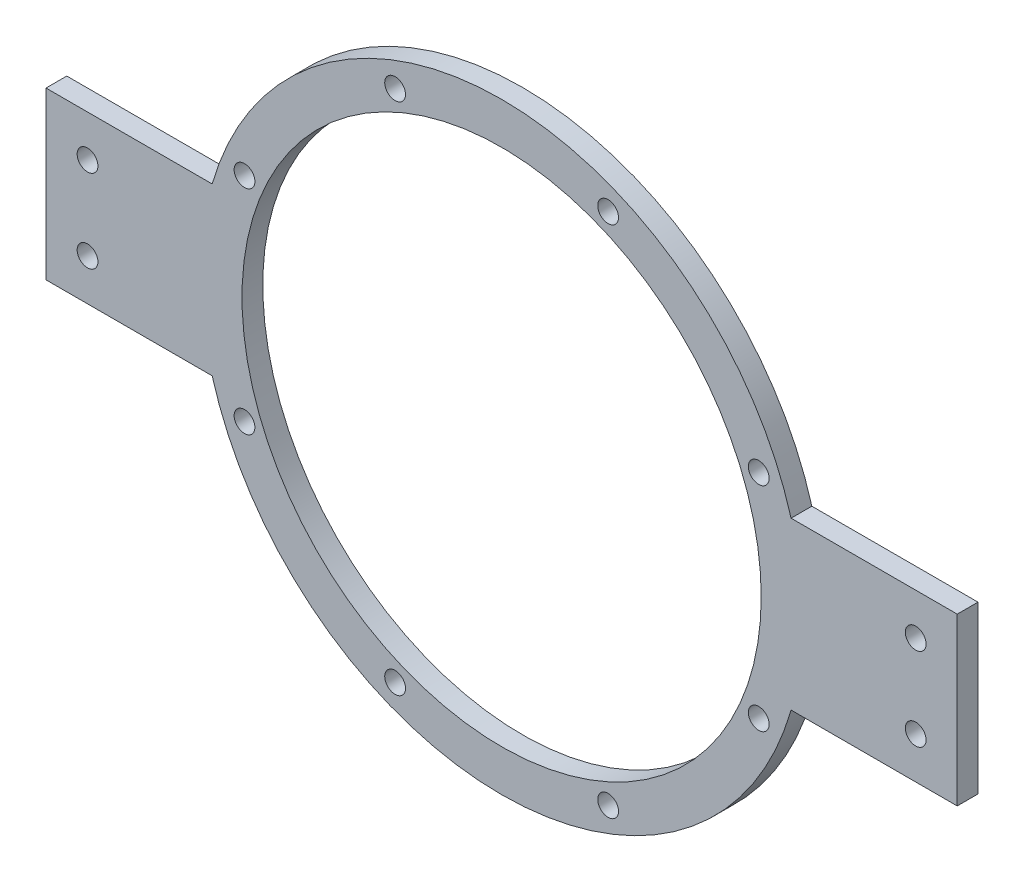
ISO-10303-21;
HEADER;
FILE_DESCRIPTION(('STEP AP214'),'2;1');
FILE_NAME('part.step','',(''),(''),'','','');
FILE_SCHEMA(('AUTOMOTIVE_DESIGN { 1 0 10303 214 1 1 1 1 }'));
ENDSEC;
DATA;
#1=APPLICATION_CONTEXT('core data for automotive mechanical design processes');
#2=APPLICATION_PROTOCOL_DEFINITION('international standard','automotive_design',2000,#1);
#3=PRODUCT_CONTEXT('',#1,'mechanical');
#4=PRODUCT('Part','Part','',(#3));
#5=PRODUCT_RELATED_PRODUCT_CATEGORY('part','',(#4));
#6=PRODUCT_DEFINITION_FORMATION('','',#4);
#7=PRODUCT_DEFINITION_CONTEXT('part definition',#1,'design');
#8=PRODUCT_DEFINITION('design','',#6,#7);
#9=PRODUCT_DEFINITION_SHAPE('','',#8);
#10=(LENGTH_UNIT() NAMED_UNIT(*) SI_UNIT(.MILLI.,.METRE.));
#11=(NAMED_UNIT(*) PLANE_ANGLE_UNIT() SI_UNIT($,.RADIAN.));
#12=(NAMED_UNIT(*) SI_UNIT($,.STERADIAN.) SOLID_ANGLE_UNIT());
#13=UNCERTAINTY_MEASURE_WITH_UNIT(LENGTH_MEASURE(1.E-05),#10,'distance_accuracy_value','');
#14=(GEOMETRIC_REPRESENTATION_CONTEXT(3) GLOBAL_UNCERTAINTY_ASSIGNED_CONTEXT((#13)) GLOBAL_UNIT_ASSIGNED_CONTEXT((#10,
#11,#12)) REPRESENTATION_CONTEXT('',''));
#15=CARTESIAN_POINT('',(0.,0.,0.));
#16=DIRECTION('',(0.,0.,1.));
#17=DIRECTION('',(1.,0.,0.));
#18=AXIS2_PLACEMENT_3D('',#15,#16,#17);
#19=CARTESIAN_POINT('',(0.,0.,6.35));
#20=DIRECTION('',(0.,0.,1.));
#21=DIRECTION('',(1.,0.,0.));
#22=AXIS2_PLACEMENT_3D('',#19,#20,#21);
#23=PLANE('',#22);
#24=CARTESIAN_POINT('',(-32.5625332599455,-78.6129094213854,6.35));
#25=DIRECTION('',(0.,0.,1.));
#26=DIRECTION('',(1.,0.,0.));
#27=AXIS2_PLACEMENT_3D('',#24,#25,#26);
#28=CIRCLE('',#27,3.17500000000706);
#29=CARTESIAN_POINT('',(-29.3875332599384,-78.6129094213854,6.35));
#30=VERTEX_POINT('',#29);
#31=EDGE_CURVE('E362',#30,#30,#28,.T.);
#32=ORIENTED_EDGE('',*,*,#31,.F.);
#33=EDGE_LOOP('',(#32));
#34=FACE_BOUND('',#33,.T.);
#35=CARTESIAN_POINT('',(-126.602235141266,12.6999999999999,6.35));
#36=DIRECTION('',(0.,0.,1.));
#37=DIRECTION('',(1.,0.,0.));
#38=AXIS2_PLACEMENT_3D('',#35,#36,#37);
#39=CIRCLE('',#38,3.175);
#40=CARTESIAN_POINT('',(-123.427235141266,12.6999999999999,6.35));
#41=VERTEX_POINT('',#40);
#42=EDGE_CURVE('E368',#41,#41,#39,.T.);
#43=ORIENTED_EDGE('',*,*,#42,.F.);
#44=EDGE_LOOP('',(#43));
#45=FACE_BOUND('',#44,.T.);
#46=CARTESIAN_POINT('',(32.5625332599455,78.6129094213854,6.35));
#47=DIRECTION('',(0.,0.,1.));
#48=DIRECTION('',(1.,0.,0.));
#49=AXIS2_PLACEMENT_3D('',#46,#47,#48);
#50=CIRCLE('',#49,3.17500000000719);
#51=CARTESIAN_POINT('',(35.7375332599527,78.6129094213854,6.35));
#52=VERTEX_POINT('',#51);
#53=EDGE_CURVE('E382',#52,#52,#50,.T.);
#54=ORIENTED_EDGE('',*,*,#53,.F.);
#55=EDGE_LOOP('',(#54));
#56=FACE_BOUND('',#55,.T.);
#57=CARTESIAN_POINT('',(78.6129094213854,32.5625332599455,6.35));
#58=DIRECTION('',(0.,0.,1.));
#59=DIRECTION('',(1.,0.,0.));
#60=AXIS2_PLACEMENT_3D('',#57,#58,#59);
#61=CIRCLE('',#60,3.17500000000719);
#62=CARTESIAN_POINT('',(81.7879094213926,32.5625332599455,6.35));
#63=VERTEX_POINT('',#62);
#64=EDGE_CURVE('E377',#63,#63,#61,.T.);
#65=ORIENTED_EDGE('',*,*,#64,.F.);
#66=EDGE_LOOP('',(#65));
#67=FACE_BOUND('',#66,.T.);
#68=CARTESIAN_POINT('',(126.602235141266,-12.7,6.35));
#69=DIRECTION('',(0.,0.,1.));
#70=DIRECTION('',(1.,0.,0.));
#71=AXIS2_PLACEMENT_3D('',#68,#69,#70);
#72=CIRCLE('',#71,3.175);
#73=CARTESIAN_POINT('',(129.777235141266,-12.7,6.35));
#74=VERTEX_POINT('',#73);
#75=EDGE_CURVE('E381',#74,#74,#72,.T.);
#76=ORIENTED_EDGE('',*,*,#75,.F.);
#77=EDGE_LOOP('',(#76));
#78=FACE_BOUND('',#77,.T.);
#79=CARTESIAN_POINT('',(126.602235141266,12.7000000000001,6.35));
#80=DIRECTION('',(0.,0.,1.));
#81=DIRECTION('',(1.,0.,0.));
#82=AXIS2_PLACEMENT_3D('',#79,#80,#81);
#83=CIRCLE('',#82,3.175);
#84=CARTESIAN_POINT('',(129.777235141266,12.7000000000001,6.35));
#85=VERTEX_POINT('',#84);
#86=EDGE_CURVE('E397',#85,#85,#83,.T.);
#87=ORIENTED_EDGE('',*,*,#86,.F.);
#88=EDGE_LOOP('',(#87));
#89=FACE_BOUND('',#88,.T.);
#90=CARTESIAN_POINT('',(78.6129094213854,-32.5625332599455,6.35));
#91=DIRECTION('',(0.,0.,1.));
#92=DIRECTION('',(1.,0.,0.));
#93=AXIS2_PLACEMENT_3D('',#90,#91,#92);
#94=CIRCLE('',#93,3.17500000000714);
#95=CARTESIAN_POINT('',(81.7879094213925,-32.5625332599455,6.35));
#96=VERTEX_POINT('',#95);
#97=EDGE_CURVE('E393',#96,#96,#94,.T.);
#98=ORIENTED_EDGE('',*,*,#97,.F.);
#99=EDGE_LOOP('',(#98));
#100=FACE_BOUND('',#99,.T.);
#101=CARTESIAN_POINT('',(-78.6129094213854,-32.5625332599455,6.35));
#102=DIRECTION('',(0.,0.,1.));
#103=DIRECTION('',(1.,0.,0.));
#104=AXIS2_PLACEMENT_3D('',#101,#102,#103);
#105=CIRCLE('',#104,3.17500000000706);
#106=CARTESIAN_POINT('',(-75.4379094213783,-32.5625332599455,6.35));
#107=VERTEX_POINT('',#106);
#108=EDGE_CURVE('E389',#107,#107,#105,.T.);
#109=ORIENTED_EDGE('',*,*,#108,.F.);
#110=EDGE_LOOP('',(#109));
#111=FACE_BOUND('',#110,.T.);
#112=CARTESIAN_POINT('',(32.5625332599455,-78.6129094213854,6.35));
#113=DIRECTION('',(0.,0.,1.));
#114=DIRECTION('',(1.,0.,0.));
#115=AXIS2_PLACEMENT_3D('',#112,#113,#114);
#116=CIRCLE('',#115,3.17500000000712);
#117=CARTESIAN_POINT('',(35.7375332599526,-78.6129094213854,6.35));
#118=VERTEX_POINT('',#117);
#119=EDGE_CURVE('E348',#118,#118,#116,.T.);
#120=ORIENTED_EDGE('',*,*,#119,.F.);
#121=EDGE_LOOP('',(#120));
#122=FACE_BOUND('',#121,.T.);
#123=CARTESIAN_POINT('',(-32.5625332599455,78.6129094213854,6.35));
#124=DIRECTION('',(0.,0.,1.));
#125=DIRECTION('',(1.,0.,0.));
#126=AXIS2_PLACEMENT_3D('',#123,#124,#125);
#127=CIRCLE('',#126,3.17500000000714);
#128=CARTESIAN_POINT('',(-29.3875332599383,78.6129094213854,6.35));
#129=VERTEX_POINT('',#128);
#130=EDGE_CURVE('E363',#129,#129,#127,.T.);
#131=ORIENTED_EDGE('',*,*,#130,.F.);
#132=EDGE_LOOP('',(#131));
#133=FACE_BOUND('',#132,.T.);
#134=CARTESIAN_POINT('',(-78.6129094213854,32.5625332599455,6.35));
#135=DIRECTION('',(0.,0.,1.));
#136=DIRECTION('',(1.,0.,0.));
#137=AXIS2_PLACEMENT_3D('',#134,#135,#136);
#138=CIRCLE('',#137,3.17500000000707);
#139=CARTESIAN_POINT('',(-75.4379094213783,32.5625332599455,6.35));
#140=VERTEX_POINT('',#139);
#141=EDGE_CURVE('E371',#140,#140,#138,.T.);
#142=ORIENTED_EDGE('',*,*,#141,.F.);
#143=EDGE_LOOP('',(#142));
#144=FACE_BOUND('',#143,.T.);
#145=CARTESIAN_POINT('',(-126.602235141266,-12.7,6.35));
#146=DIRECTION('',(0.,0.,1.));
#147=DIRECTION('',(1.,0.,0.));
#148=AXIS2_PLACEMENT_3D('',#145,#146,#147);
#149=CIRCLE('',#148,3.175);
#150=CARTESIAN_POINT('',(-123.427235141266,-12.7,6.35));
#151=VERTEX_POINT('',#150);
#152=EDGE_CURVE('E193',#151,#151,#149,.T.);
#153=ORIENTED_EDGE('',*,*,#152,.F.);
#154=EDGE_LOOP('',(#153));
#155=FACE_BOUND('',#154,.T.);
#156=DIRECTION('',(0.,-1.,0.));
#157=VECTOR('',#156,1.);
#158=CARTESIAN_POINT('',(-139.302235141266,25.4,6.35));
#159=LINE('',#158,#157);
#160=CARTESIAN_POINT('',(-139.302235141266,25.4,6.35));
#161=VERTEX_POINT('',#160);
#162=CARTESIAN_POINT('',(-139.302235141266,-25.4,6.35));
#163=VERTEX_POINT('',#162);
#164=EDGE_CURVE('E170',#161,#163,#159,.T.);
#165=ORIENTED_EDGE('',*,*,#164,.T.);
#166=DIRECTION('',(1.,0.,0.));
#167=VECTOR('',#166,1.);
#168=CARTESIAN_POINT('',(-139.302235141266,-25.4,6.35));
#169=LINE('',#168,#167);
#170=CARTESIAN_POINT('',(-88.5022351412663,-25.4000000000001,6.35));
#171=VERTEX_POINT('',#170);
#172=EDGE_CURVE('E106',#163,#171,#169,.T.);
#173=ORIENTED_EDGE('',*,*,#172,.T.);
#174=CARTESIAN_POINT('',(0.,0.,6.35));
#175=DIRECTION('',(0.,0.,1.));
#176=DIRECTION('',(1.,0.,0.));
#177=AXIS2_PLACEMENT_3D('',#174,#175,#176);
#178=CIRCLE('',#177,92.075);
#179=CARTESIAN_POINT('',(88.5022351412664,-25.4,6.35));
#180=VERTEX_POINT('',#179);
#181=EDGE_CURVE('E252',#171,#180,#178,.T.);
#182=ORIENTED_EDGE('',*,*,#181,.T.);
#183=DIRECTION('',(1.,0.,0.));
#184=VECTOR('',#183,1.);
#185=CARTESIAN_POINT('',(139.302235141266,-25.3999999999999,6.35));
#186=LINE('',#185,#184);
#187=CARTESIAN_POINT('',(139.302235141266,-25.3999999999999,6.35));
#188=VERTEX_POINT('',#187);
#189=EDGE_CURVE('E255',#180,#188,#186,.T.);
#190=ORIENTED_EDGE('',*,*,#189,.T.);
#191=DIRECTION('',(0.,1.,0.));
#192=VECTOR('',#191,1.);
#193=CARTESIAN_POINT('',(139.302235141266,25.4000000000001,6.35));
#194=LINE('',#193,#192);
#195=CARTESIAN_POINT('',(139.302235141266,25.4000000000001,6.35));
#196=VERTEX_POINT('',#195);
#197=EDGE_CURVE('E125',#188,#196,#194,.T.);
#198=ORIENTED_EDGE('',*,*,#197,.T.);
#199=DIRECTION('',(-1.,0.,0.));
#200=VECTOR('',#199,1.);
#201=CARTESIAN_POINT('',(139.302235141266,25.4000000000001,6.35));
#202=LINE('',#201,#200);
#203=CARTESIAN_POINT('',(88.5022351412664,25.4,6.35));
#204=VERTEX_POINT('',#203);
#205=EDGE_CURVE('E119',#196,#204,#202,.T.);
#206=ORIENTED_EDGE('',*,*,#205,.T.);
#207=CARTESIAN_POINT('',(0.,0.,6.35));
#208=DIRECTION('',(0.,0.,1.));
#209=DIRECTION('',(1.,0.,0.));
#210=AXIS2_PLACEMENT_3D('',#207,#208,#209);
#211=CIRCLE('',#210,92.075);
#212=CARTESIAN_POINT('',(-88.5022351412664,25.3999999999999,6.35));
#213=VERTEX_POINT('',#212);
#214=EDGE_CURVE('E123',#204,#213,#211,.T.);
#215=ORIENTED_EDGE('',*,*,#214,.T.);
#216=DIRECTION('',(-1.,0.,0.));
#217=VECTOR('',#216,1.);
#218=CARTESIAN_POINT('',(-139.302235141266,25.4,6.35));
#219=LINE('',#218,#217);
#220=EDGE_CURVE('E63',#213,#161,#219,.T.);
#221=ORIENTED_EDGE('',*,*,#220,.T.);
#222=EDGE_LOOP('',(#165,#173,#182,#190,#198,#206,#215,#221));
#223=FACE_BOUND('',#222,.T.);
#224=CARTESIAN_POINT('',(0.,0.,6.35));
#225=DIRECTION('',(0.,0.,1.));
#226=DIRECTION('',(1.,0.,0.));
#227=AXIS2_PLACEMENT_3D('',#224,#225,#226);
#228=CIRCLE('',#227,79.375);
#229=CARTESIAN_POINT('',(79.375,0.,6.35));
#230=VERTEX_POINT('',#229);
#231=EDGE_CURVE('E152',#230,#230,#228,.T.);
#232=ORIENTED_EDGE('',*,*,#231,.F.);
#233=EDGE_LOOP('',(#232));
#234=FACE_BOUND('',#233,.T.);
#235=ADVANCED_FACE('F43',(#34,#45,#56,#67,#78,#89,#100,#111,#122,#133,#144,#155,#223,#234),#23,.T.);
#236=CARTESIAN_POINT('',(0.,0.,0.));
#237=DIRECTION('',(0.,0.,1.));
#238=DIRECTION('',(1.,0.,0.));
#239=AXIS2_PLACEMENT_3D('',#236,#237,#238);
#240=PLANE('',#239);
#241=CARTESIAN_POINT('',(-32.5625332599455,-78.6129094213854,0.));
#242=DIRECTION('',(0.,0.,1.));
#243=DIRECTION('',(1.,0.,0.));
#244=AXIS2_PLACEMENT_3D('',#241,#242,#243);
#245=CIRCLE('',#244,3.17500000000706);
#246=CARTESIAN_POINT('',(-29.3875332599384,-78.6129094213854,0.));
#247=VERTEX_POINT('',#246);
#248=EDGE_CURVE('E47',#247,#247,#245,.T.);
#249=ORIENTED_EDGE('',*,*,#248,.T.);
#250=EDGE_LOOP('',(#249));
#251=FACE_BOUND('',#250,.T.);
#252=CARTESIAN_POINT('',(-126.602235141266,12.6999999999999,0.));
#253=DIRECTION('',(0.,0.,1.));
#254=DIRECTION('',(1.,0.,0.));
#255=AXIS2_PLACEMENT_3D('',#252,#253,#254);
#256=CIRCLE('',#255,3.175);
#257=CARTESIAN_POINT('',(-123.427235141266,12.6999999999999,0.));
#258=VERTEX_POINT('',#257);
#259=EDGE_CURVE('E228',#258,#258,#256,.T.);
#260=ORIENTED_EDGE('',*,*,#259,.T.);
#261=EDGE_LOOP('',(#260));
#262=FACE_BOUND('',#261,.T.);
#263=CARTESIAN_POINT('',(32.5625332599455,78.6129094213854,0.));
#264=DIRECTION('',(0.,0.,1.));
#265=DIRECTION('',(1.,0.,0.));
#266=AXIS2_PLACEMENT_3D('',#263,#264,#265);
#267=CIRCLE('',#266,3.17500000000719);
#268=CARTESIAN_POINT('',(35.7375332599527,78.6129094213854,0.));
#269=VERTEX_POINT('',#268);
#270=EDGE_CURVE('E225',#269,#269,#267,.T.);
#271=ORIENTED_EDGE('',*,*,#270,.T.);
#272=EDGE_LOOP('',(#271));
#273=FACE_BOUND('',#272,.T.);
#274=CARTESIAN_POINT('',(78.6129094213854,32.5625332599455,0.));
#275=DIRECTION('',(0.,0.,1.));
#276=DIRECTION('',(1.,0.,0.));
#277=AXIS2_PLACEMENT_3D('',#274,#275,#276);
#278=CIRCLE('',#277,3.17500000000719);
#279=CARTESIAN_POINT('',(81.7879094213926,32.5625332599455,0.));
#280=VERTEX_POINT('',#279);
#281=EDGE_CURVE('E221',#280,#280,#278,.T.);
#282=ORIENTED_EDGE('',*,*,#281,.T.);
#283=EDGE_LOOP('',(#282));
#284=FACE_BOUND('',#283,.T.);
#285=CARTESIAN_POINT('',(126.602235141266,-12.7,0.));
#286=DIRECTION('',(0.,0.,1.));
#287=DIRECTION('',(1.,0.,0.));
#288=AXIS2_PLACEMENT_3D('',#285,#286,#287);
#289=CIRCLE('',#288,3.175);
#290=CARTESIAN_POINT('',(129.777235141266,-12.7,0.));
#291=VERTEX_POINT('',#290);
#292=EDGE_CURVE('E217',#291,#291,#289,.T.);
#293=ORIENTED_EDGE('',*,*,#292,.T.);
#294=EDGE_LOOP('',(#293));
#295=FACE_BOUND('',#294,.T.);
#296=CARTESIAN_POINT('',(126.602235141266,12.7000000000001,0.));
#297=DIRECTION('',(0.,0.,1.));
#298=DIRECTION('',(1.,0.,0.));
#299=AXIS2_PLACEMENT_3D('',#296,#297,#298);
#300=CIRCLE('',#299,3.175);
#301=CARTESIAN_POINT('',(129.777235141266,12.7000000000001,0.));
#302=VERTEX_POINT('',#301);
#303=EDGE_CURVE('E213',#302,#302,#300,.T.);
#304=ORIENTED_EDGE('',*,*,#303,.T.);
#305=EDGE_LOOP('',(#304));
#306=FACE_BOUND('',#305,.T.);
#307=CARTESIAN_POINT('',(78.6129094213854,-32.5625332599455,0.));
#308=DIRECTION('',(0.,0.,1.));
#309=DIRECTION('',(1.,0.,0.));
#310=AXIS2_PLACEMENT_3D('',#307,#308,#309);
#311=CIRCLE('',#310,3.17500000000714);
#312=CARTESIAN_POINT('',(81.7879094213925,-32.5625332599455,0.));
#313=VERTEX_POINT('',#312);
#314=EDGE_CURVE('E209',#313,#313,#311,.T.);
#315=ORIENTED_EDGE('',*,*,#314,.T.);
#316=EDGE_LOOP('',(#315));
#317=FACE_BOUND('',#316,.T.);
#318=CARTESIAN_POINT('',(-78.6129094213854,-32.5625332599455,0.));
#319=DIRECTION('',(0.,0.,1.));
#320=DIRECTION('',(1.,0.,0.));
#321=AXIS2_PLACEMENT_3D('',#318,#319,#320);
#322=CIRCLE('',#321,3.17500000000706);
#323=CARTESIAN_POINT('',(-75.4379094213783,-32.5625332599455,0.));
#324=VERTEX_POINT('',#323);
#325=EDGE_CURVE('E205',#324,#324,#322,.T.);
#326=ORIENTED_EDGE('',*,*,#325,.T.);
#327=EDGE_LOOP('',(#326));
#328=FACE_BOUND('',#327,.T.);
#329=CARTESIAN_POINT('',(32.5625332599455,-78.6129094213854,0.));
#330=DIRECTION('',(0.,0.,1.));
#331=DIRECTION('',(1.,0.,0.));
#332=AXIS2_PLACEMENT_3D('',#329,#330,#331);
#333=CIRCLE('',#332,3.17500000000712);
#334=CARTESIAN_POINT('',(35.7375332599526,-78.6129094213854,0.));
#335=VERTEX_POINT('',#334);
#336=EDGE_CURVE('E201',#335,#335,#333,.T.);
#337=ORIENTED_EDGE('',*,*,#336,.T.);
#338=EDGE_LOOP('',(#337));
#339=FACE_BOUND('',#338,.T.);
#340=CARTESIAN_POINT('',(-32.5625332599455,78.6129094213854,0.));
#341=DIRECTION('',(0.,0.,1.));
#342=DIRECTION('',(1.,0.,0.));
#343=AXIS2_PLACEMENT_3D('',#340,#341,#342);
#344=CIRCLE('',#343,3.17500000000714);
#345=CARTESIAN_POINT('',(-29.3875332599383,78.6129094213854,0.));
#346=VERTEX_POINT('',#345);
#347=EDGE_CURVE('E197',#346,#346,#344,.T.);
#348=ORIENTED_EDGE('',*,*,#347,.T.);
#349=EDGE_LOOP('',(#348));
#350=FACE_BOUND('',#349,.T.);
#351=CARTESIAN_POINT('',(-78.6129094213854,32.5625332599455,0.));
#352=DIRECTION('',(0.,0.,1.));
#353=DIRECTION('',(1.,0.,0.));
#354=AXIS2_PLACEMENT_3D('',#351,#352,#353);
#355=CIRCLE('',#354,3.17500000000707);
#356=CARTESIAN_POINT('',(-75.4379094213783,32.5625332599455,0.));
#357=VERTEX_POINT('',#356);
#358=EDGE_CURVE('E192',#357,#357,#355,.T.);
#359=ORIENTED_EDGE('',*,*,#358,.T.);
#360=EDGE_LOOP('',(#359));
#361=FACE_BOUND('',#360,.T.);
#362=CARTESIAN_POINT('',(-126.602235141266,-12.7,0.));
#363=DIRECTION('',(0.,0.,1.));
#364=DIRECTION('',(1.,0.,0.));
#365=AXIS2_PLACEMENT_3D('',#362,#363,#364);
#366=CIRCLE('',#365,3.175);
#367=CARTESIAN_POINT('',(-123.427235141266,-12.7,0.));
#368=VERTEX_POINT('',#367);
#369=EDGE_CURVE('E188',#368,#368,#366,.T.);
#370=ORIENTED_EDGE('',*,*,#369,.T.);
#371=EDGE_LOOP('',(#370));
#372=FACE_BOUND('',#371,.T.);
#373=DIRECTION('',(0.,-1.,0.));
#374=VECTOR('',#373,1.);
#375=CARTESIAN_POINT('',(-139.302235141266,25.4,0.));
#376=LINE('',#375,#374);
#377=CARTESIAN_POINT('',(-139.302235141266,25.4,0.));
#378=VERTEX_POINT('',#377);
#379=CARTESIAN_POINT('',(-139.302235141266,-25.4,0.));
#380=VERTEX_POINT('',#379);
#381=EDGE_CURVE('E147',#378,#380,#376,.T.);
#382=ORIENTED_EDGE('',*,*,#381,.F.);
#383=DIRECTION('',(-1.,0.,0.));
#384=VECTOR('',#383,1.);
#385=CARTESIAN_POINT('',(-139.302235141266,25.4,0.));
#386=LINE('',#385,#384);
#387=CARTESIAN_POINT('',(-88.5022351412664,25.3999999999999,0.));
#388=VERTEX_POINT('',#387);
#389=EDGE_CURVE('E98',#388,#378,#386,.T.);
#390=ORIENTED_EDGE('',*,*,#389,.F.);
#391=CARTESIAN_POINT('',(0.,0.,0.));
#392=DIRECTION('',(0.,0.,1.));
#393=DIRECTION('',(1.,0.,0.));
#394=AXIS2_PLACEMENT_3D('',#391,#392,#393);
#395=CIRCLE('',#394,92.075);
#396=CARTESIAN_POINT('',(88.5022351412664,25.4,0.));
#397=VERTEX_POINT('',#396);
#398=EDGE_CURVE('E92',#397,#388,#395,.T.);
#399=ORIENTED_EDGE('',*,*,#398,.F.);
#400=DIRECTION('',(-1.,0.,0.));
#401=VECTOR('',#400,1.);
#402=CARTESIAN_POINT('',(139.302235141266,25.4000000000001,0.));
#403=LINE('',#402,#401);
#404=CARTESIAN_POINT('',(139.302235141266,25.4000000000001,0.));
#405=VERTEX_POINT('',#404);
#406=EDGE_CURVE('E134',#405,#397,#403,.T.);
#407=ORIENTED_EDGE('',*,*,#406,.F.);
#408=DIRECTION('',(0.,1.,0.));
#409=VECTOR('',#408,1.);
#410=CARTESIAN_POINT('',(139.302235141266,25.4000000000001,0.));
#411=LINE('',#410,#409);
#412=CARTESIAN_POINT('',(139.302235141266,-25.3999999999999,0.));
#413=VERTEX_POINT('',#412);
#414=EDGE_CURVE('E161',#413,#405,#411,.T.);
#415=ORIENTED_EDGE('',*,*,#414,.F.);
#416=DIRECTION('',(1.,0.,0.));
#417=VECTOR('',#416,1.);
#418=CARTESIAN_POINT('',(139.302235141266,-25.3999999999999,0.));
#419=LINE('',#418,#417);
#420=CARTESIAN_POINT('',(88.5022351412664,-25.4,0.));
#421=VERTEX_POINT('',#420);
#422=EDGE_CURVE('E158',#421,#413,#419,.T.);
#423=ORIENTED_EDGE('',*,*,#422,.F.);
#424=CARTESIAN_POINT('',(0.,0.,0.));
#425=DIRECTION('',(0.,0.,1.));
#426=DIRECTION('',(1.,0.,0.));
#427=AXIS2_PLACEMENT_3D('',#424,#425,#426);
#428=CIRCLE('',#427,92.075);
#429=CARTESIAN_POINT('',(-88.5022351412663,-25.4000000000001,0.));
#430=VERTEX_POINT('',#429);
#431=EDGE_CURVE('E155',#430,#421,#428,.T.);
#432=ORIENTED_EDGE('',*,*,#431,.F.);
#433=DIRECTION('',(1.,0.,0.));
#434=VECTOR('',#433,1.);
#435=CARTESIAN_POINT('',(-139.302235141266,-25.4,0.));
#436=LINE('',#435,#434);
#437=EDGE_CURVE('E151',#380,#430,#436,.T.);
#438=ORIENTED_EDGE('',*,*,#437,.F.);
#439=EDGE_LOOP('',(#382,#390,#399,#407,#415,#423,#432,#438));
#440=FACE_BOUND('',#439,.T.);
#441=CARTESIAN_POINT('',(0.,0.,0.));
#442=DIRECTION('',(0.,0.,1.));
#443=DIRECTION('',(1.,0.,0.));
#444=AXIS2_PLACEMENT_3D('',#441,#442,#443);
#445=CIRCLE('',#444,79.375);
#446=CARTESIAN_POINT('',(79.375,0.,0.));
#447=VERTEX_POINT('',#446);
#448=EDGE_CURVE('E235',#447,#447,#445,.T.);
#449=ORIENTED_EDGE('',*,*,#448,.T.);
#450=EDGE_LOOP('',(#449));
#451=FACE_BOUND('',#450,.T.);
#452=ADVANCED_FACE('F270',(#251,#262,#273,#284,#295,#306,#317,#328,#339,#350,#361,#372,#440,
#451),#240,.F.);
#453=CARTESIAN_POINT('',(-139.302235141266,25.4,6.35));
#454=DIRECTION('',(1.,0.,0.));
#455=DIRECTION('',(0.,0.,-1.));
#456=AXIS2_PLACEMENT_3D('',#453,#454,#455);
#457=PLANE('',#456);
#458=ORIENTED_EDGE('',*,*,#381,.T.);
#459=DIRECTION('',(0.,0.,-1.));
#460=VECTOR('',#459,1.);
#461=CARTESIAN_POINT('',(-139.302235141266,-25.4,6.35));
#462=LINE('',#461,#460);
#463=EDGE_CURVE('E11',#163,#380,#462,.T.);
#464=ORIENTED_EDGE('',*,*,#463,.F.);
#465=ORIENTED_EDGE('',*,*,#164,.F.);
#466=DIRECTION('',(0.,0.,-1.));
#467=VECTOR('',#466,1.);
#468=CARTESIAN_POINT('',(-139.302235141266,25.4,6.35));
#469=LINE('',#468,#467);
#470=EDGE_CURVE('E143',#161,#378,#469,.T.);
#471=ORIENTED_EDGE('',*,*,#470,.T.);
#472=EDGE_LOOP('',(#458,#464,#465,#471));
#473=FACE_BOUND('',#472,.T.);
#474=ADVANCED_FACE('F45',(#473),#457,.F.);
#475=CARTESIAN_POINT('',(-139.302235141266,-25.4,6.35));
#476=DIRECTION('',(0.,1.,0.));
#477=DIRECTION('',(-1.,0.,0.));
#478=AXIS2_PLACEMENT_3D('',#475,#476,#477);
#479=PLANE('',#478);
#480=ORIENTED_EDGE('',*,*,#437,.T.);
#481=DIRECTION('',(0.,0.,-1.));
#482=VECTOR('',#481,1.);
#483=CARTESIAN_POINT('',(-88.5022351412663,-25.4000000000001,6.35));
#484=LINE('',#483,#482);
#485=EDGE_CURVE('E54',#171,#430,#484,.T.);
#486=ORIENTED_EDGE('',*,*,#485,.F.);
#487=ORIENTED_EDGE('',*,*,#172,.F.);
#488=ORIENTED_EDGE('',*,*,#463,.T.);
#489=EDGE_LOOP('',(#480,#486,#487,#488));
#490=FACE_BOUND('',#489,.T.);
#491=ADVANCED_FACE('F592',(#490),#479,.F.);
#492=CARTESIAN_POINT('',(0.,0.,6.35));
#493=DIRECTION('',(0.,0.,-1.));
#494=DIRECTION('',(-1.,0.,0.));
#495=AXIS2_PLACEMENT_3D('',#492,#493,#494);
#496=CYLINDRICAL_SURFACE('',#495,92.075);
#497=ORIENTED_EDGE('',*,*,#431,.T.);
#498=DIRECTION('',(0.,0.,-1.));
#499=VECTOR('',#498,1.);
#500=CARTESIAN_POINT('',(88.5022351412664,-25.4,6.35));
#501=LINE('',#500,#499);
#502=EDGE_CURVE('E181',#180,#421,#501,.T.);
#503=ORIENTED_EDGE('',*,*,#502,.F.);
#504=ORIENTED_EDGE('',*,*,#181,.F.);
#505=ORIENTED_EDGE('',*,*,#485,.T.);
#506=EDGE_LOOP('',(#497,#503,#504,#505));
#507=FACE_BOUND('',#506,.T.);
#508=ADVANCED_FACE('F582',(#507),#496,.T.);
#509=CARTESIAN_POINT('',(139.302235141266,-25.3999999999999,6.35));
#510=DIRECTION('',(0.,1.,0.));
#511=DIRECTION('',(-1.,0.,0.));
#512=AXIS2_PLACEMENT_3D('',#509,#510,#511);
#513=PLANE('',#512);
#514=ORIENTED_EDGE('',*,*,#422,.T.);
#515=DIRECTION('',(0.,0.,-1.));
#516=VECTOR('',#515,1.);
#517=CARTESIAN_POINT('',(139.302235141266,-25.3999999999999,6.35));
#518=LINE('',#517,#516);
#519=EDGE_CURVE('E177',#188,#413,#518,.T.);
#520=ORIENTED_EDGE('',*,*,#519,.F.);
#521=ORIENTED_EDGE('',*,*,#189,.F.);
#522=ORIENTED_EDGE('',*,*,#502,.T.);
#523=EDGE_LOOP('',(#514,#520,#521,#522));
#524=FACE_BOUND('',#523,.T.);
#525=ADVANCED_FACE('F263',(#524),#513,.F.);
#526=CARTESIAN_POINT('',(139.302235141266,25.4000000000001,6.35));
#527=DIRECTION('',(-1.,0.,0.));
#528=DIRECTION('',(0.,-1.,0.));
#529=AXIS2_PLACEMENT_3D('',#526,#527,#528);
#530=PLANE('',#529);
#531=ORIENTED_EDGE('',*,*,#414,.T.);
#532=DIRECTION('',(0.,0.,-1.));
#533=VECTOR('',#532,1.);
#534=CARTESIAN_POINT('',(139.302235141266,25.4000000000001,6.35));
#535=LINE('',#534,#533);
#536=EDGE_CURVE('E136',#196,#405,#535,.T.);
#537=ORIENTED_EDGE('',*,*,#536,.F.);
#538=ORIENTED_EDGE('',*,*,#197,.F.);
#539=ORIENTED_EDGE('',*,*,#519,.T.);
#540=EDGE_LOOP('',(#531,#537,#538,#539));
#541=FACE_BOUND('',#540,.T.);
#542=ADVANCED_FACE('F267',(#541),#530,.F.);
#543=CARTESIAN_POINT('',(139.302235141266,25.4000000000001,6.35));
#544=DIRECTION('',(0.,-1.,0.));
#545=DIRECTION('',(1.,0.,0.));
#546=AXIS2_PLACEMENT_3D('',#543,#544,#545);
#547=PLANE('',#546);
#548=ORIENTED_EDGE('',*,*,#406,.T.);
#549=DIRECTION('',(0.,0.,-1.));
#550=VECTOR('',#549,1.);
#551=CARTESIAN_POINT('',(88.5022351412664,25.4,6.35));
#552=LINE('',#551,#550);
#553=EDGE_CURVE('E131',#204,#397,#552,.T.);
#554=ORIENTED_EDGE('',*,*,#553,.F.);
#555=ORIENTED_EDGE('',*,*,#205,.F.);
#556=ORIENTED_EDGE('',*,*,#536,.T.);
#557=EDGE_LOOP('',(#548,#554,#555,#556));
#558=FACE_BOUND('',#557,.T.);
#559=ADVANCED_FACE('F132',(#558),#547,.F.);
#560=CARTESIAN_POINT('',(0.,0.,6.35));
#561=DIRECTION('',(0.,0.,-1.));
#562=DIRECTION('',(-1.,0.,0.));
#563=AXIS2_PLACEMENT_3D('',#560,#561,#562);
#564=CYLINDRICAL_SURFACE('',#563,92.075);
#565=ORIENTED_EDGE('',*,*,#398,.T.);
#566=DIRECTION('',(0.,0.,-1.));
#567=VECTOR('',#566,1.);
#568=CARTESIAN_POINT('',(-88.5022351412664,25.3999999999999,6.35));
#569=LINE('',#568,#567);
#570=EDGE_CURVE('E137',#213,#388,#569,.T.);
#571=ORIENTED_EDGE('',*,*,#570,.F.);
#572=ORIENTED_EDGE('',*,*,#214,.F.);
#573=ORIENTED_EDGE('',*,*,#553,.T.);
#574=EDGE_LOOP('',(#565,#571,#572,#573));
#575=FACE_BOUND('',#574,.T.);
#576=ADVANCED_FACE('F139',(#575),#564,.T.);
#577=CARTESIAN_POINT('',(-139.302235141266,25.4,6.35));
#578=DIRECTION('',(0.,-1.,0.));
#579=DIRECTION('',(1.,0.,0.));
#580=AXIS2_PLACEMENT_3D('',#577,#578,#579);
#581=PLANE('',#580);
#582=ORIENTED_EDGE('',*,*,#389,.T.);
#583=ORIENTED_EDGE('',*,*,#470,.F.);
#584=ORIENTED_EDGE('',*,*,#220,.F.);
#585=ORIENTED_EDGE('',*,*,#570,.T.);
#586=EDGE_LOOP('',(#582,#583,#584,#585));
#587=FACE_BOUND('',#586,.T.);
#588=ADVANCED_FACE('F275',(#587),#581,.F.);
#589=CARTESIAN_POINT('',(0.,0.,6.35));
#590=DIRECTION('',(0.,0.,-1.));
#591=DIRECTION('',(-1.,0.,0.));
#592=AXIS2_PLACEMENT_3D('',#589,#590,#591);
#593=CYLINDRICAL_SURFACE('',#592,79.375);
#594=ORIENTED_EDGE('',*,*,#231,.T.);
#595=EDGE_LOOP('',(#594));
#596=FACE_BOUND('',#595,.T.);
#597=ORIENTED_EDGE('',*,*,#448,.F.);
#598=EDGE_LOOP('',(#597));
#599=FACE_BOUND('',#598,.T.);
#600=ADVANCED_FACE('F277',(#596,#599),#593,.F.);
#601=CARTESIAN_POINT('',(-126.602235141266,-12.7,-69.85));
#602=DIRECTION('',(0.,0.,1.));
#603=DIRECTION('',(1.,0.,0.));
#604=AXIS2_PLACEMENT_3D('',#601,#602,#603);
#605=CYLINDRICAL_SURFACE('',#604,3.175);
#606=ORIENTED_EDGE('',*,*,#152,.T.);
#607=EDGE_LOOP('',(#606));
#608=FACE_BOUND('',#607,.T.);
#609=ORIENTED_EDGE('',*,*,#369,.F.);
#610=EDGE_LOOP('',(#609));
#611=FACE_BOUND('',#610,.T.);
#612=ADVANCED_FACE('F283',(#608,#611),#605,.F.);
#613=CARTESIAN_POINT('',(-78.6129094213854,32.5625332599455,-69.85));
#614=DIRECTION('',(0.,0.,1.));
#615=DIRECTION('',(1.,0.,0.));
#616=AXIS2_PLACEMENT_3D('',#613,#614,#615);
#617=CYLINDRICAL_SURFACE('',#616,3.17500000000707);
#618=ORIENTED_EDGE('',*,*,#141,.T.);
#619=EDGE_LOOP('',(#618));
#620=FACE_BOUND('',#619,.T.);
#621=ORIENTED_EDGE('',*,*,#358,.F.);
#622=EDGE_LOOP('',(#621));
#623=FACE_BOUND('',#622,.T.);
#624=ADVANCED_FACE('F299',(#620,#623),#617,.F.);
#625=CARTESIAN_POINT('',(-32.5625332599455,78.6129094213854,-69.85));
#626=DIRECTION('',(0.,0.,1.));
#627=DIRECTION('',(1.,0.,0.));
#628=AXIS2_PLACEMENT_3D('',#625,#626,#627);
#629=CYLINDRICAL_SURFACE('',#628,3.17500000000714);
#630=ORIENTED_EDGE('',*,*,#130,.T.);
#631=EDGE_LOOP('',(#630));
#632=FACE_BOUND('',#631,.T.);
#633=ORIENTED_EDGE('',*,*,#347,.F.);
#634=EDGE_LOOP('',(#633));
#635=FACE_BOUND('',#634,.T.);
#636=ADVANCED_FACE('F336',(#632,#635),#629,.F.);
#637=CARTESIAN_POINT('',(32.5625332599455,-78.6129094213854,-69.85));
#638=DIRECTION('',(0.,0.,1.));
#639=DIRECTION('',(1.,0.,0.));
#640=AXIS2_PLACEMENT_3D('',#637,#638,#639);
#641=CYLINDRICAL_SURFACE('',#640,3.17500000000712);
#642=ORIENTED_EDGE('',*,*,#119,.T.);
#643=EDGE_LOOP('',(#642));
#644=FACE_BOUND('',#643,.T.);
#645=ORIENTED_EDGE('',*,*,#336,.F.);
#646=EDGE_LOOP('',(#645));
#647=FACE_BOUND('',#646,.T.);
#648=ADVANCED_FACE('F317',(#644,#647),#641,.F.);
#649=CARTESIAN_POINT('',(-78.6129094213854,-32.5625332599455,-69.85));
#650=DIRECTION('',(0.,0.,1.));
#651=DIRECTION('',(1.,0.,0.));
#652=AXIS2_PLACEMENT_3D('',#649,#650,#651);
#653=CYLINDRICAL_SURFACE('',#652,3.17500000000706);
#654=ORIENTED_EDGE('',*,*,#108,.T.);
#655=EDGE_LOOP('',(#654));
#656=FACE_BOUND('',#655,.T.);
#657=ORIENTED_EDGE('',*,*,#325,.F.);
#658=EDGE_LOOP('',(#657));
#659=FACE_BOUND('',#658,.T.);
#660=ADVANCED_FACE('F313',(#656,#659),#653,.F.);
#661=CARTESIAN_POINT('',(78.6129094213854,-32.5625332599455,-69.85));
#662=DIRECTION('',(0.,0.,1.));
#663=DIRECTION('',(1.,0.,0.));
#664=AXIS2_PLACEMENT_3D('',#661,#662,#663);
#665=CYLINDRICAL_SURFACE('',#664,3.17500000000714);
#666=ORIENTED_EDGE('',*,*,#97,.T.);
#667=EDGE_LOOP('',(#666));
#668=FACE_BOUND('',#667,.T.);
#669=ORIENTED_EDGE('',*,*,#314,.F.);
#670=EDGE_LOOP('',(#669));
#671=FACE_BOUND('',#670,.T.);
#672=ADVANCED_FACE('F309',(#668,#671),#665,.F.);
#673=CARTESIAN_POINT('',(126.602235141266,12.7000000000001,-69.85));
#674=DIRECTION('',(0.,0.,1.));
#675=DIRECTION('',(1.,0.,0.));
#676=AXIS2_PLACEMENT_3D('',#673,#674,#675);
#677=CYLINDRICAL_SURFACE('',#676,3.175);
#678=ORIENTED_EDGE('',*,*,#86,.T.);
#679=EDGE_LOOP('',(#678));
#680=FACE_BOUND('',#679,.T.);
#681=ORIENTED_EDGE('',*,*,#303,.F.);
#682=EDGE_LOOP('',(#681));
#683=FACE_BOUND('',#682,.T.);
#684=ADVANCED_FACE('F305',(#680,#683),#677,.F.);
#685=CARTESIAN_POINT('',(126.602235141266,-12.7,-69.85));
#686=DIRECTION('',(0.,0.,1.));
#687=DIRECTION('',(1.,0.,0.));
#688=AXIS2_PLACEMENT_3D('',#685,#686,#687);
#689=CYLINDRICAL_SURFACE('',#688,3.175);
#690=ORIENTED_EDGE('',*,*,#75,.T.);
#691=EDGE_LOOP('',(#690));
#692=FACE_BOUND('',#691,.T.);
#693=ORIENTED_EDGE('',*,*,#292,.F.);
#694=EDGE_LOOP('',(#693));
#695=FACE_BOUND('',#694,.T.);
#696=ADVANCED_FACE('F301',(#692,#695),#689,.F.);
#697=CARTESIAN_POINT('',(78.6129094213854,32.5625332599455,-69.85));
#698=DIRECTION('',(0.,0.,1.));
#699=DIRECTION('',(1.,0.,0.));
#700=AXIS2_PLACEMENT_3D('',#697,#698,#699);
#701=CYLINDRICAL_SURFACE('',#700,3.17500000000719);
#702=ORIENTED_EDGE('',*,*,#64,.T.);
#703=EDGE_LOOP('',(#702));
#704=FACE_BOUND('',#703,.T.);
#705=ORIENTED_EDGE('',*,*,#281,.F.);
#706=EDGE_LOOP('',(#705));
#707=FACE_BOUND('',#706,.T.);
#708=ADVANCED_FACE('F304',(#704,#707),#701,.F.);
#709=CARTESIAN_POINT('',(32.5625332599455,78.6129094213854,-69.85));
#710=DIRECTION('',(0.,0.,1.));
#711=DIRECTION('',(1.,0.,0.));
#712=AXIS2_PLACEMENT_3D('',#709,#710,#711);
#713=CYLINDRICAL_SURFACE('',#712,3.17500000000719);
#714=ORIENTED_EDGE('',*,*,#53,.T.);
#715=EDGE_LOOP('',(#714));
#716=FACE_BOUND('',#715,.T.);
#717=ORIENTED_EDGE('',*,*,#270,.F.);
#718=EDGE_LOOP('',(#717));
#719=FACE_BOUND('',#718,.T.);
#720=ADVANCED_FACE('F326',(#716,#719),#713,.F.);
#721=CARTESIAN_POINT('',(-126.602235141266,12.6999999999999,-69.85));
#722=DIRECTION('',(0.,0.,1.));
#723=DIRECTION('',(1.,0.,0.));
#724=AXIS2_PLACEMENT_3D('',#721,#722,#723);
#725=CYLINDRICAL_SURFACE('',#724,3.175);
#726=ORIENTED_EDGE('',*,*,#42,.T.);
#727=EDGE_LOOP('',(#726));
#728=FACE_BOUND('',#727,.T.);
#729=ORIENTED_EDGE('',*,*,#259,.F.);
#730=EDGE_LOOP('',(#729));
#731=FACE_BOUND('',#730,.T.);
#732=ADVANCED_FACE('F322',(#728,#731),#725,.F.);
#733=CARTESIAN_POINT('',(-32.5625332599455,-78.6129094213854,-69.85));
#734=DIRECTION('',(0.,0.,1.));
#735=DIRECTION('',(1.,0.,0.));
#736=AXIS2_PLACEMENT_3D('',#733,#734,#735);
#737=CYLINDRICAL_SURFACE('',#736,3.17500000000706);
#738=ORIENTED_EDGE('',*,*,#31,.T.);
#739=EDGE_LOOP('',(#738));
#740=FACE_BOUND('',#739,.T.);
#741=ORIENTED_EDGE('',*,*,#248,.F.);
#742=EDGE_LOOP('',(#741));
#743=FACE_BOUND('',#742,.T.);
#744=ADVANCED_FACE('F319',(#740,#743),#737,.F.);
#745=CLOSED_SHELL('',(#235,#452,#474,#491,#508,#525,#542,#559,#576,#588,#600,#612,#624,#636,
#648,#660,#672,#684,#696,#708,#720,#732,#744));
#746=MANIFOLD_SOLID_BREP('B2',#745);
#747=ADVANCED_BREP_SHAPE_REPRESENTATION('',(#18,#746),#14);
#748=SHAPE_DEFINITION_REPRESENTATION(#9,#747);
ENDSEC;
END-ISO-10303-21;
